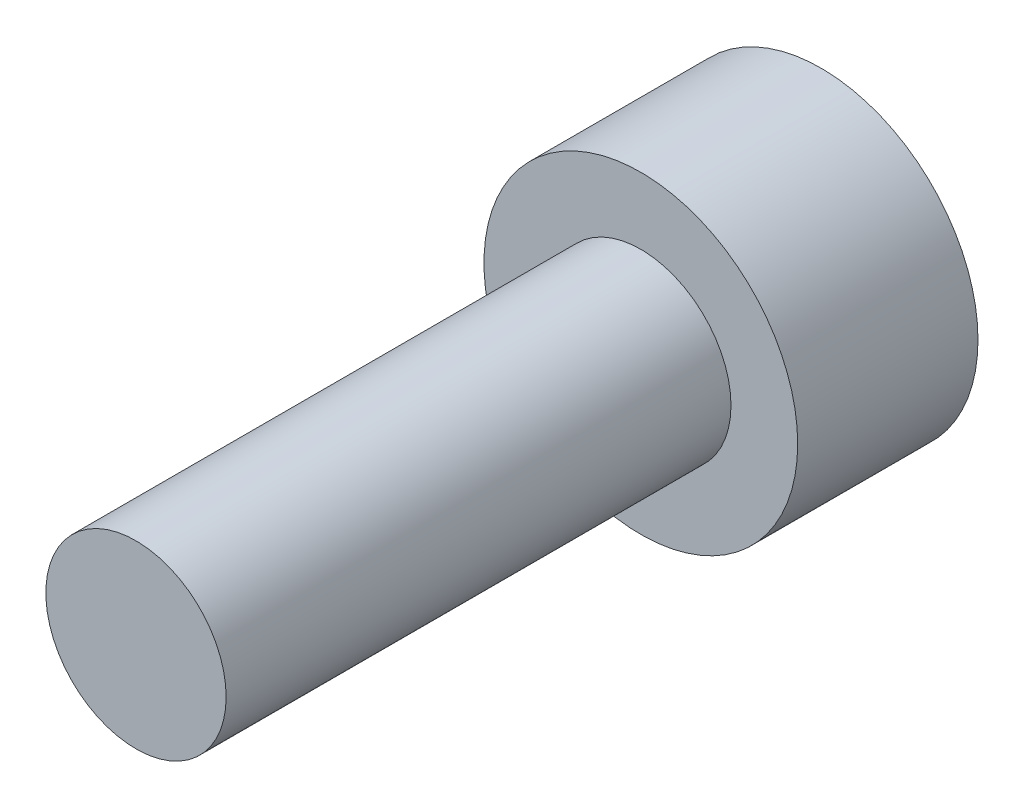
ISO-10303-21;
HEADER;
FILE_DESCRIPTION(('STEP AP214'),'2;1');
FILE_NAME('part.step','',(''),(''),'','','');
FILE_SCHEMA(('AUTOMOTIVE_DESIGN { 1 0 10303 214 1 1 1 1 }'));
ENDSEC;
DATA;
#1=APPLICATION_CONTEXT('core data for automotive mechanical design processes');
#2=APPLICATION_PROTOCOL_DEFINITION('international standard','automotive_design',2000,#1);
#3=PRODUCT_CONTEXT('',#1,'mechanical');
#4=PRODUCT('Part','Part','',(#3));
#5=PRODUCT_RELATED_PRODUCT_CATEGORY('part','',(#4));
#6=PRODUCT_DEFINITION_FORMATION('','',#4);
#7=PRODUCT_DEFINITION_CONTEXT('part definition',#1,'design');
#8=PRODUCT_DEFINITION('design','',#6,#7);
#9=PRODUCT_DEFINITION_SHAPE('','',#8);
#10=(LENGTH_UNIT() NAMED_UNIT(*) SI_UNIT(.MILLI.,.METRE.));
#11=(NAMED_UNIT(*) PLANE_ANGLE_UNIT() SI_UNIT($,.RADIAN.));
#12=(NAMED_UNIT(*) SI_UNIT($,.STERADIAN.) SOLID_ANGLE_UNIT());
#13=UNCERTAINTY_MEASURE_WITH_UNIT(LENGTH_MEASURE(1.E-05),#10,'distance_accuracy_value','');
#14=(GEOMETRIC_REPRESENTATION_CONTEXT(3) GLOBAL_UNCERTAINTY_ASSIGNED_CONTEXT((#13)) GLOBAL_UNIT_ASSIGNED_CONTEXT((#10,
#11,#12)) REPRESENTATION_CONTEXT('',''));
#15=CARTESIAN_POINT('',(0.,0.,0.));
#16=DIRECTION('',(0.,0.,1.));
#17=DIRECTION('',(1.,0.,0.));
#18=AXIS2_PLACEMENT_3D('',#15,#16,#17);
#19=CARTESIAN_POINT('',(0.,0.,5.));
#20=DIRECTION('',(0.,0.,-1.));
#21=DIRECTION('',(-1.,0.,0.));
#22=AXIS2_PLACEMENT_3D('',#19,#20,#21);
#23=CYLINDRICAL_SURFACE('',#22,4.35);
#24=CARTESIAN_POINT('',(0.,0.,5.));
#25=DIRECTION('',(0.,0.,1.));
#26=DIRECTION('',(1.,0.,0.));
#27=AXIS2_PLACEMENT_3D('',#24,#25,#26);
#28=CIRCLE('',#27,4.35);
#29=CARTESIAN_POINT('',(4.35,0.,5.));
#30=VERTEX_POINT('',#29);
#31=EDGE_CURVE('E38',#30,#30,#28,.T.);
#32=ORIENTED_EDGE('',*,*,#31,.F.);
#33=EDGE_LOOP('',(#32));
#34=FACE_BOUND('',#33,.T.);
#35=CARTESIAN_POINT('',(0.,0.,0.));
#36=DIRECTION('',(0.,0.,1.));
#37=DIRECTION('',(1.,0.,0.));
#38=AXIS2_PLACEMENT_3D('',#35,#36,#37);
#39=CIRCLE('',#38,4.35);
#40=CARTESIAN_POINT('',(4.35,0.,0.));
#41=VERTEX_POINT('',#40);
#42=EDGE_CURVE('E34',#41,#41,#39,.T.);
#43=ORIENTED_EDGE('',*,*,#42,.T.);
#44=EDGE_LOOP('',(#43));
#45=FACE_BOUND('',#44,.T.);
#46=ADVANCED_FACE('F31',(#34,#45),#23,.T.);
#47=CARTESIAN_POINT('',(0.,0.,5.));
#48=DIRECTION('',(0.,0.,1.));
#49=DIRECTION('',(1.,0.,0.));
#50=AXIS2_PLACEMENT_3D('',#47,#48,#49);
#51=PLANE('',#50);
#52=CARTESIAN_POINT('',(0.,0.,5.));
#53=DIRECTION('',(0.,0.,1.));
#54=DIRECTION('',(1.,0.,0.));
#55=AXIS2_PLACEMENT_3D('',#52,#53,#54);
#56=CIRCLE('',#55,2.5);
#57=CARTESIAN_POINT('',(2.5,0.,5.));
#58=VERTEX_POINT('',#57);
#59=EDGE_CURVE('E10',#58,#58,#56,.T.);
#60=ORIENTED_EDGE('',*,*,#59,.F.);
#61=EDGE_LOOP('',(#60));
#62=FACE_BOUND('',#61,.T.);
#63=ORIENTED_EDGE('',*,*,#31,.T.);
#64=EDGE_LOOP('',(#63));
#65=FACE_BOUND('',#64,.T.);
#66=ADVANCED_FACE('F55',(#62,#65),#51,.T.);
#67=CARTESIAN_POINT('',(0.,0.,0.));
#68=DIRECTION('',(0.,0.,1.));
#69=DIRECTION('',(1.,0.,0.));
#70=AXIS2_PLACEMENT_3D('',#67,#68,#69);
#71=PLANE('',#70);
#72=ORIENTED_EDGE('',*,*,#42,.F.);
#73=EDGE_LOOP('',(#72));
#74=FACE_BOUND('',#73,.T.);
#75=ADVANCED_FACE('F52',(#74),#71,.F.);
#76=CARTESIAN_POINT('',(0.,0.,19.));
#77=DIRECTION('',(0.,0.,-1.));
#78=DIRECTION('',(-1.,0.,0.));
#79=AXIS2_PLACEMENT_3D('',#76,#77,#78);
#80=CYLINDRICAL_SURFACE('',#79,2.5);
#81=CARTESIAN_POINT('',(0.,0.,19.));
#82=DIRECTION('',(0.,0.,1.));
#83=DIRECTION('',(1.,0.,0.));
#84=AXIS2_PLACEMENT_3D('',#81,#82,#83);
#85=CIRCLE('',#84,2.5);
#86=CARTESIAN_POINT('',(2.5,0.,19.));
#87=VERTEX_POINT('',#86);
#88=EDGE_CURVE('E44',#87,#87,#85,.T.);
#89=ORIENTED_EDGE('',*,*,#88,.F.);
#90=EDGE_LOOP('',(#89));
#91=FACE_BOUND('',#90,.T.);
#92=ORIENTED_EDGE('',*,*,#59,.T.);
#93=EDGE_LOOP('',(#92));
#94=FACE_BOUND('',#93,.T.);
#95=ADVANCED_FACE('F54',(#91,#94),#80,.T.);
#96=CARTESIAN_POINT('',(0.,0.,19.));
#97=DIRECTION('',(0.,0.,1.));
#98=DIRECTION('',(1.,0.,0.));
#99=AXIS2_PLACEMENT_3D('',#96,#97,#98);
#100=PLANE('',#99);
#101=ORIENTED_EDGE('',*,*,#88,.T.);
#102=EDGE_LOOP('',(#101));
#103=FACE_BOUND('',#102,.T.);
#104=ADVANCED_FACE('F60',(#103),#100,.T.);
#105=CLOSED_SHELL('',(#46,#66,#75,#95,#104));
#106=MANIFOLD_SOLID_BREP('B2',#105);
#107=ADVANCED_BREP_SHAPE_REPRESENTATION('',(#18,#106),#14);
#108=SHAPE_DEFINITION_REPRESENTATION(#9,#107);
ENDSEC;
END-ISO-10303-21;
